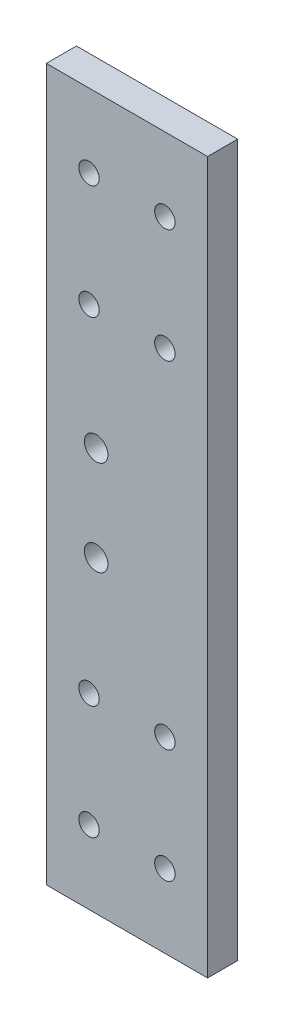
ISO-10303-21;
HEADER;
FILE_DESCRIPTION(('STEP AP214'),'2;1');
FILE_NAME('part.step','',(''),(''),'','','');
FILE_SCHEMA(('AUTOMOTIVE_DESIGN { 1 0 10303 214 1 1 1 1 }'));
ENDSEC;
DATA;
#1=APPLICATION_CONTEXT('core data for automotive mechanical design processes');
#2=APPLICATION_PROTOCOL_DEFINITION('international standard','automotive_design',2000,#1);
#3=PRODUCT_CONTEXT('',#1,'mechanical');
#4=PRODUCT('Part','Part','',(#3));
#5=PRODUCT_RELATED_PRODUCT_CATEGORY('part','',(#4));
#6=PRODUCT_DEFINITION_FORMATION('','',#4);
#7=PRODUCT_DEFINITION_CONTEXT('part definition',#1,'design');
#8=PRODUCT_DEFINITION('design','',#6,#7);
#9=PRODUCT_DEFINITION_SHAPE('','',#8);
#10=(LENGTH_UNIT() NAMED_UNIT(*) SI_UNIT(.MILLI.,.METRE.));
#11=(NAMED_UNIT(*) PLANE_ANGLE_UNIT() SI_UNIT($,.RADIAN.));
#12=(NAMED_UNIT(*) SI_UNIT($,.STERADIAN.) SOLID_ANGLE_UNIT());
#13=UNCERTAINTY_MEASURE_WITH_UNIT(LENGTH_MEASURE(1.E-05),#10,'distance_accuracy_value','');
#14=(GEOMETRIC_REPRESENTATION_CONTEXT(3) GLOBAL_UNCERTAINTY_ASSIGNED_CONTEXT((#13)) GLOBAL_UNIT_ASSIGNED_CONTEXT((#10,
#11,#12)) REPRESENTATION_CONTEXT('',''));
#15=CARTESIAN_POINT('',(0.,0.,0.));
#16=DIRECTION('',(0.,0.,1.));
#17=DIRECTION('',(1.,0.,0.));
#18=AXIS2_PLACEMENT_3D('',#15,#16,#17);
#19=CARTESIAN_POINT('',(-17.,-75.,6.35));
#20=DIRECTION('',(0.,1.,0.));
#21=DIRECTION('',(0.,0.,1.));
#22=AXIS2_PLACEMENT_3D('',#19,#20,#21);
#23=PLANE('',#22);
#24=DIRECTION('',(1.,0.,0.));
#25=VECTOR('',#24,1.);
#26=CARTESIAN_POINT('',(-17.,-75.,0.));
#27=LINE('',#26,#25);
#28=CARTESIAN_POINT('',(-17.,-75.,0.));
#29=VERTEX_POINT('',#28);
#30=CARTESIAN_POINT('',(17.,-75.,0.));
#31=VERTEX_POINT('',#30);
#32=EDGE_CURVE('E96',#29,#31,#27,.T.);
#33=ORIENTED_EDGE('',*,*,#32,.T.);
#34=DIRECTION('',(0.,0.,-1.));
#35=VECTOR('',#34,1.);
#36=CARTESIAN_POINT('',(17.,-75.,6.35));
#37=LINE('',#36,#35);
#38=CARTESIAN_POINT('',(17.,-75.,6.35));
#39=VERTEX_POINT('',#38);
#40=EDGE_CURVE('E11',#39,#31,#37,.T.);
#41=ORIENTED_EDGE('',*,*,#40,.F.);
#42=DIRECTION('',(1.,0.,0.));
#43=VECTOR('',#42,1.);
#44=CARTESIAN_POINT('',(-17.,-75.,6.35));
#45=LINE('',#44,#43);
#46=CARTESIAN_POINT('',(-17.,-75.,6.35));
#47=VERTEX_POINT('',#46);
#48=EDGE_CURVE('E84',#47,#39,#45,.T.);
#49=ORIENTED_EDGE('',*,*,#48,.F.);
#50=DIRECTION('',(0.,0.,-1.));
#51=VECTOR('',#50,1.);
#52=CARTESIAN_POINT('',(-17.,-75.,6.35));
#53=LINE('',#52,#51);
#54=EDGE_CURVE('E92',#47,#29,#53,.T.);
#55=ORIENTED_EDGE('',*,*,#54,.T.);
#56=EDGE_LOOP('',(#33,#41,#49,#55));
#57=FACE_BOUND('',#56,.T.);
#58=ADVANCED_FACE('F33',(#57),#23,.F.);
#59=CARTESIAN_POINT('',(17.,-75.,6.35));
#60=DIRECTION('',(-1.,0.,0.));
#61=DIRECTION('',(0.,0.,1.));
#62=AXIS2_PLACEMENT_3D('',#59,#60,#61);
#63=PLANE('',#62);
#64=DIRECTION('',(0.,1.,0.));
#65=VECTOR('',#64,1.);
#66=CARTESIAN_POINT('',(17.,-75.,0.));
#67=LINE('',#66,#65);
#68=CARTESIAN_POINT('',(17.,75.,0.));
#69=VERTEX_POINT('',#68);
#70=EDGE_CURVE('E88',#31,#69,#67,.T.);
#71=ORIENTED_EDGE('',*,*,#70,.T.);
#72=DIRECTION('',(0.,0.,-1.));
#73=VECTOR('',#72,1.);
#74=CARTESIAN_POINT('',(17.,75.,6.35));
#75=LINE('',#74,#73);
#76=CARTESIAN_POINT('',(17.,75.,6.35));
#77=VERTEX_POINT('',#76);
#78=EDGE_CURVE('E41',#77,#69,#75,.T.);
#79=ORIENTED_EDGE('',*,*,#78,.F.);
#80=DIRECTION('',(0.,1.,0.));
#81=VECTOR('',#80,1.);
#82=CARTESIAN_POINT('',(17.,-75.,6.35));
#83=LINE('',#82,#81);
#84=EDGE_CURVE('E79',#39,#77,#83,.T.);
#85=ORIENTED_EDGE('',*,*,#84,.F.);
#86=ORIENTED_EDGE('',*,*,#40,.T.);
#87=EDGE_LOOP('',(#71,#79,#85,#86));
#88=FACE_BOUND('',#87,.T.);
#89=ADVANCED_FACE('F87',(#88),#63,.F.);
#90=CARTESIAN_POINT('',(-17.,75.,6.35));
#91=DIRECTION('',(0.,-1.,0.));
#92=DIRECTION('',(0.,0.,-1.));
#93=AXIS2_PLACEMENT_3D('',#90,#91,#92);
#94=PLANE('',#93);
#95=DIRECTION('',(-1.,0.,0.));
#96=VECTOR('',#95,1.);
#97=CARTESIAN_POINT('',(-17.,75.,0.));
#98=LINE('',#97,#96);
#99=CARTESIAN_POINT('',(-17.,75.,0.));
#100=VERTEX_POINT('',#99);
#101=EDGE_CURVE('E66',#69,#100,#98,.T.);
#102=ORIENTED_EDGE('',*,*,#101,.T.);
#103=DIRECTION('',(0.,0.,-1.));
#104=VECTOR('',#103,1.);
#105=CARTESIAN_POINT('',(-17.,75.,6.35));
#106=LINE('',#105,#104);
#107=CARTESIAN_POINT('',(-17.,75.,6.35));
#108=VERTEX_POINT('',#107);
#109=EDGE_CURVE('E89',#108,#100,#106,.T.);
#110=ORIENTED_EDGE('',*,*,#109,.F.);
#111=DIRECTION('',(-1.,0.,0.));
#112=VECTOR('',#111,1.);
#113=CARTESIAN_POINT('',(-17.,75.,6.35));
#114=LINE('',#113,#112);
#115=EDGE_CURVE('E82',#77,#108,#114,.T.);
#116=ORIENTED_EDGE('',*,*,#115,.F.);
#117=ORIENTED_EDGE('',*,*,#78,.T.);
#118=EDGE_LOOP('',(#102,#110,#116,#117));
#119=FACE_BOUND('',#118,.T.);
#120=ADVANCED_FACE('F90',(#119),#94,.F.);
#121=CARTESIAN_POINT('',(-17.,-75.,6.35));
#122=DIRECTION('',(1.,0.,0.));
#123=DIRECTION('',(0.,0.,-1.));
#124=AXIS2_PLACEMENT_3D('',#121,#122,#123);
#125=PLANE('',#124);
#126=DIRECTION('',(0.,-1.,0.));
#127=VECTOR('',#126,1.);
#128=CARTESIAN_POINT('',(-17.,-75.,0.));
#129=LINE('',#128,#127);
#130=EDGE_CURVE('E72',#100,#29,#129,.T.);
#131=ORIENTED_EDGE('',*,*,#130,.T.);
#132=ORIENTED_EDGE('',*,*,#54,.F.);
#133=DIRECTION('',(0.,-1.,0.));
#134=VECTOR('',#133,1.);
#135=CARTESIAN_POINT('',(-17.,-75.,6.35));
#136=LINE('',#135,#134);
#137=EDGE_CURVE('E49',#108,#47,#136,.T.);
#138=ORIENTED_EDGE('',*,*,#137,.F.);
#139=ORIENTED_EDGE('',*,*,#109,.T.);
#140=EDGE_LOOP('',(#131,#132,#138,#139));
#141=FACE_BOUND('',#140,.T.);
#142=ADVANCED_FACE('F104',(#141),#125,.F.);
#143=CARTESIAN_POINT('',(0.,0.,6.35));
#144=DIRECTION('',(0.,0.,1.));
#145=DIRECTION('',(1.,0.,0.));
#146=AXIS2_PLACEMENT_3D('',#143,#144,#145);
#147=PLANE('',#146);
#148=CARTESIAN_POINT('',(-6.5,10.,6.35));
#149=DIRECTION('',(0.,0.,1.));
#150=DIRECTION('',(1.,0.,0.));
#151=AXIS2_PLACEMENT_3D('',#148,#149,#150);
#152=CIRCLE('',#151,2.48919999999999);
#153=CARTESIAN_POINT('',(-4.01080000000001,10.,6.35));
#154=VERTEX_POINT('',#153);
#155=EDGE_CURVE('E166',#154,#154,#152,.T.);
#156=ORIENTED_EDGE('',*,*,#155,.F.);
#157=EDGE_LOOP('',(#156));
#158=FACE_BOUND('',#157,.T.);
#159=CARTESIAN_POINT('',(-6.5,-10.,6.35));
#160=DIRECTION('',(0.,0.,1.));
#161=DIRECTION('',(1.,0.,0.));
#162=AXIS2_PLACEMENT_3D('',#159,#160,#161);
#163=CIRCLE('',#162,2.48919999999999);
#164=CARTESIAN_POINT('',(-4.01080000000001,-10.,6.35));
#165=VERTEX_POINT('',#164);
#166=EDGE_CURVE('E160',#165,#165,#163,.T.);
#167=ORIENTED_EDGE('',*,*,#166,.F.);
#168=EDGE_LOOP('',(#167));
#169=FACE_BOUND('',#168,.T.);
#170=CARTESIAN_POINT('',(-8.,59.5,6.35));
#171=DIRECTION('',(0.,0.,1.));
#172=DIRECTION('',(1.,0.,0.));
#173=AXIS2_PLACEMENT_3D('',#170,#171,#172);
#174=CIRCLE('',#173,2.15265);
#175=CARTESIAN_POINT('',(-5.84735,59.5,6.35));
#176=VERTEX_POINT('',#175);
#177=EDGE_CURVE('E154',#176,#176,#174,.T.);
#178=ORIENTED_EDGE('',*,*,#177,.F.);
#179=EDGE_LOOP('',(#178));
#180=FACE_BOUND('',#179,.T.);
#181=CARTESIAN_POINT('',(8.,59.5,6.35));
#182=DIRECTION('',(0.,0.,1.));
#183=DIRECTION('',(1.,0.,0.));
#184=AXIS2_PLACEMENT_3D('',#181,#182,#183);
#185=CIRCLE('',#184,2.15265);
#186=CARTESIAN_POINT('',(10.15265,59.5,6.35));
#187=VERTEX_POINT('',#186);
#188=EDGE_CURVE('E148',#187,#187,#185,.T.);
#189=ORIENTED_EDGE('',*,*,#188,.F.);
#190=EDGE_LOOP('',(#189));
#191=FACE_BOUND('',#190,.T.);
#192=CARTESIAN_POINT('',(8.,35.5,6.35));
#193=DIRECTION('',(0.,0.,1.));
#194=DIRECTION('',(1.,0.,0.));
#195=AXIS2_PLACEMENT_3D('',#192,#193,#194);
#196=CIRCLE('',#195,2.15265);
#197=CARTESIAN_POINT('',(10.15265,35.5,6.35));
#198=VERTEX_POINT('',#197);
#199=EDGE_CURVE('E142',#198,#198,#196,.T.);
#200=ORIENTED_EDGE('',*,*,#199,.F.);
#201=EDGE_LOOP('',(#200));
#202=FACE_BOUND('',#201,.T.);
#203=CARTESIAN_POINT('',(-8.,35.5,6.35));
#204=DIRECTION('',(0.,0.,1.));
#205=DIRECTION('',(1.,0.,0.));
#206=AXIS2_PLACEMENT_3D('',#203,#204,#205);
#207=CIRCLE('',#206,2.15265);
#208=CARTESIAN_POINT('',(-5.84735,35.5,6.35));
#209=VERTEX_POINT('',#208);
#210=EDGE_CURVE('E136',#209,#209,#207,.T.);
#211=ORIENTED_EDGE('',*,*,#210,.F.);
#212=EDGE_LOOP('',(#211));
#213=FACE_BOUND('',#212,.T.);
#214=CARTESIAN_POINT('',(-7.99999999999999,-35.5,6.35));
#215=DIRECTION('',(0.,0.,1.));
#216=DIRECTION('',(1.,0.,0.));
#217=AXIS2_PLACEMENT_3D('',#214,#215,#216);
#218=CIRCLE('',#217,2.15265);
#219=CARTESIAN_POINT('',(-5.84734999999999,-35.5,6.35));
#220=VERTEX_POINT('',#219);
#221=EDGE_CURVE('E130',#220,#220,#218,.T.);
#222=ORIENTED_EDGE('',*,*,#221,.F.);
#223=EDGE_LOOP('',(#222));
#224=FACE_BOUND('',#223,.T.);
#225=CARTESIAN_POINT('',(-8.,-59.5,6.35));
#226=DIRECTION('',(0.,0.,1.));
#227=DIRECTION('',(1.,0.,0.));
#228=AXIS2_PLACEMENT_3D('',#225,#226,#227);
#229=CIRCLE('',#228,2.15265);
#230=CARTESIAN_POINT('',(-5.84735,-59.5,6.35));
#231=VERTEX_POINT('',#230);
#232=EDGE_CURVE('E124',#231,#231,#229,.T.);
#233=ORIENTED_EDGE('',*,*,#232,.F.);
#234=EDGE_LOOP('',(#233));
#235=FACE_BOUND('',#234,.T.);
#236=CARTESIAN_POINT('',(8.,-59.5,6.35));
#237=DIRECTION('',(0.,0.,1.));
#238=DIRECTION('',(1.,0.,0.));
#239=AXIS2_PLACEMENT_3D('',#236,#237,#238);
#240=CIRCLE('',#239,2.15265);
#241=CARTESIAN_POINT('',(10.15265,-59.5,6.35));
#242=VERTEX_POINT('',#241);
#243=EDGE_CURVE('E118',#242,#242,#240,.T.);
#244=ORIENTED_EDGE('',*,*,#243,.F.);
#245=EDGE_LOOP('',(#244));
#246=FACE_BOUND('',#245,.T.);
#247=CARTESIAN_POINT('',(8.00000000000001,-35.5,6.35));
#248=DIRECTION('',(0.,0.,1.));
#249=DIRECTION('',(1.,0.,0.));
#250=AXIS2_PLACEMENT_3D('',#247,#248,#249);
#251=CIRCLE('',#250,2.15265);
#252=CARTESIAN_POINT('',(10.15265,-35.5,6.35));
#253=VERTEX_POINT('',#252);
#254=EDGE_CURVE('E112',#253,#253,#251,.T.);
#255=ORIENTED_EDGE('',*,*,#254,.F.);
#256=EDGE_LOOP('',(#255));
#257=FACE_BOUND('',#256,.T.);
#258=ORIENTED_EDGE('',*,*,#48,.T.);
#259=ORIENTED_EDGE('',*,*,#84,.T.);
#260=ORIENTED_EDGE('',*,*,#115,.T.);
#261=ORIENTED_EDGE('',*,*,#137,.T.);
#262=EDGE_LOOP('',(#258,#259,#260,#261));
#263=FACE_BOUND('',#262,.T.);
#264=ADVANCED_FACE('F80',(#158,#169,#180,#191,#202,#213,#224,#235,#246,#257,#263),#147,.T.);
#265=CARTESIAN_POINT('',(0.,0.,0.));
#266=DIRECTION('',(0.,0.,1.));
#267=DIRECTION('',(1.,0.,0.));
#268=AXIS2_PLACEMENT_3D('',#265,#266,#267);
#269=PLANE('',#268);
#270=CARTESIAN_POINT('',(-6.5,10.,0.));
#271=DIRECTION('',(0.,0.,1.));
#272=DIRECTION('',(1.,0.,0.));
#273=AXIS2_PLACEMENT_3D('',#270,#271,#272);
#274=CIRCLE('',#273,2.4892);
#275=CARTESIAN_POINT('',(-4.0108,10.,0.));
#276=VERTEX_POINT('',#275);
#277=EDGE_CURVE('E163',#276,#276,#274,.T.);
#278=ORIENTED_EDGE('',*,*,#277,.T.);
#279=EDGE_LOOP('',(#278));
#280=FACE_BOUND('',#279,.T.);
#281=CARTESIAN_POINT('',(-6.5,-10.,0.));
#282=DIRECTION('',(0.,0.,1.));
#283=DIRECTION('',(1.,0.,0.));
#284=AXIS2_PLACEMENT_3D('',#281,#282,#283);
#285=CIRCLE('',#284,2.4892);
#286=CARTESIAN_POINT('',(-4.0108,-10.,0.));
#287=VERTEX_POINT('',#286);
#288=EDGE_CURVE('E157',#287,#287,#285,.T.);
#289=ORIENTED_EDGE('',*,*,#288,.T.);
#290=EDGE_LOOP('',(#289));
#291=FACE_BOUND('',#290,.T.);
#292=CARTESIAN_POINT('',(-8.,59.5,0.));
#293=DIRECTION('',(0.,0.,1.));
#294=DIRECTION('',(1.,0.,0.));
#295=AXIS2_PLACEMENT_3D('',#292,#293,#294);
#296=CIRCLE('',#295,2.15265);
#297=CARTESIAN_POINT('',(-5.84735,59.5,0.));
#298=VERTEX_POINT('',#297);
#299=EDGE_CURVE('E151',#298,#298,#296,.T.);
#300=ORIENTED_EDGE('',*,*,#299,.T.);
#301=EDGE_LOOP('',(#300));
#302=FACE_BOUND('',#301,.T.);
#303=CARTESIAN_POINT('',(8.,59.5,0.));
#304=DIRECTION('',(0.,0.,1.));
#305=DIRECTION('',(1.,0.,0.));
#306=AXIS2_PLACEMENT_3D('',#303,#304,#305);
#307=CIRCLE('',#306,2.15265);
#308=CARTESIAN_POINT('',(10.15265,59.5,0.));
#309=VERTEX_POINT('',#308);
#310=EDGE_CURVE('E145',#309,#309,#307,.T.);
#311=ORIENTED_EDGE('',*,*,#310,.T.);
#312=EDGE_LOOP('',(#311));
#313=FACE_BOUND('',#312,.T.);
#314=CARTESIAN_POINT('',(8.,35.5,0.));
#315=DIRECTION('',(0.,0.,1.));
#316=DIRECTION('',(1.,0.,0.));
#317=AXIS2_PLACEMENT_3D('',#314,#315,#316);
#318=CIRCLE('',#317,2.15265);
#319=CARTESIAN_POINT('',(10.15265,35.5,0.));
#320=VERTEX_POINT('',#319);
#321=EDGE_CURVE('E139',#320,#320,#318,.T.);
#322=ORIENTED_EDGE('',*,*,#321,.T.);
#323=EDGE_LOOP('',(#322));
#324=FACE_BOUND('',#323,.T.);
#325=CARTESIAN_POINT('',(-8.,35.5,0.));
#326=DIRECTION('',(0.,0.,1.));
#327=DIRECTION('',(1.,0.,0.));
#328=AXIS2_PLACEMENT_3D('',#325,#326,#327);
#329=CIRCLE('',#328,2.15265);
#330=CARTESIAN_POINT('',(-5.84735,35.5,0.));
#331=VERTEX_POINT('',#330);
#332=EDGE_CURVE('E133',#331,#331,#329,.T.);
#333=ORIENTED_EDGE('',*,*,#332,.T.);
#334=EDGE_LOOP('',(#333));
#335=FACE_BOUND('',#334,.T.);
#336=CARTESIAN_POINT('',(-7.99999999999999,-35.5,0.));
#337=DIRECTION('',(0.,0.,1.));
#338=DIRECTION('',(1.,0.,0.));
#339=AXIS2_PLACEMENT_3D('',#336,#337,#338);
#340=CIRCLE('',#339,2.15265);
#341=CARTESIAN_POINT('',(-5.84734999999999,-35.5,0.));
#342=VERTEX_POINT('',#341);
#343=EDGE_CURVE('E127',#342,#342,#340,.T.);
#344=ORIENTED_EDGE('',*,*,#343,.T.);
#345=EDGE_LOOP('',(#344));
#346=FACE_BOUND('',#345,.T.);
#347=CARTESIAN_POINT('',(-8.,-59.5,0.));
#348=DIRECTION('',(0.,0.,1.));
#349=DIRECTION('',(1.,0.,0.));
#350=AXIS2_PLACEMENT_3D('',#347,#348,#349);
#351=CIRCLE('',#350,2.15265);
#352=CARTESIAN_POINT('',(-5.84735,-59.5,0.));
#353=VERTEX_POINT('',#352);
#354=EDGE_CURVE('E121',#353,#353,#351,.T.);
#355=ORIENTED_EDGE('',*,*,#354,.T.);
#356=EDGE_LOOP('',(#355));
#357=FACE_BOUND('',#356,.T.);
#358=CARTESIAN_POINT('',(8.,-59.5,0.));
#359=DIRECTION('',(0.,0.,1.));
#360=DIRECTION('',(1.,0.,0.));
#361=AXIS2_PLACEMENT_3D('',#358,#359,#360);
#362=CIRCLE('',#361,2.15265);
#363=CARTESIAN_POINT('',(10.15265,-59.5,0.));
#364=VERTEX_POINT('',#363);
#365=EDGE_CURVE('E115',#364,#364,#362,.T.);
#366=ORIENTED_EDGE('',*,*,#365,.T.);
#367=EDGE_LOOP('',(#366));
#368=FACE_BOUND('',#367,.T.);
#369=CARTESIAN_POINT('',(8.00000000000001,-35.5,0.));
#370=DIRECTION('',(0.,0.,1.));
#371=DIRECTION('',(1.,0.,0.));
#372=AXIS2_PLACEMENT_3D('',#369,#370,#371);
#373=CIRCLE('',#372,2.15265);
#374=CARTESIAN_POINT('',(10.15265,-35.5,0.));
#375=VERTEX_POINT('',#374);
#376=EDGE_CURVE('E99',#375,#375,#373,.T.);
#377=ORIENTED_EDGE('',*,*,#376,.T.);
#378=EDGE_LOOP('',(#377));
#379=FACE_BOUND('',#378,.T.);
#380=ORIENTED_EDGE('',*,*,#32,.F.);
#381=ORIENTED_EDGE('',*,*,#130,.F.);
#382=ORIENTED_EDGE('',*,*,#101,.F.);
#383=ORIENTED_EDGE('',*,*,#70,.F.);
#384=EDGE_LOOP('',(#380,#381,#382,#383));
#385=FACE_BOUND('',#384,.T.);
#386=ADVANCED_FACE('F107',(#280,#291,#302,#313,#324,#335,#346,#357,#368,#379,#385),#269,.F.);
#387=CARTESIAN_POINT('',(8.00000000000001,-35.5,6.35));
#388=DIRECTION('',(0.,0.,1.));
#389=DIRECTION('',(1.,0.,0.));
#390=AXIS2_PLACEMENT_3D('',#387,#388,#389);
#391=CYLINDRICAL_SURFACE('',#390,2.15265);
#392=ORIENTED_EDGE('',*,*,#376,.F.);
#393=EDGE_LOOP('',(#392));
#394=FACE_BOUND('',#393,.T.);
#395=ORIENTED_EDGE('',*,*,#254,.T.);
#396=EDGE_LOOP('',(#395));
#397=FACE_BOUND('',#396,.T.);
#398=ADVANCED_FACE('F193',(#394,#397),#391,.F.);
#399=CARTESIAN_POINT('',(8.,-59.5,6.35));
#400=DIRECTION('',(0.,0.,1.));
#401=DIRECTION('',(1.,0.,0.));
#402=AXIS2_PLACEMENT_3D('',#399,#400,#401);
#403=CYLINDRICAL_SURFACE('',#402,2.15265);
#404=ORIENTED_EDGE('',*,*,#365,.F.);
#405=EDGE_LOOP('',(#404));
#406=FACE_BOUND('',#405,.T.);
#407=ORIENTED_EDGE('',*,*,#243,.T.);
#408=EDGE_LOOP('',(#407));
#409=FACE_BOUND('',#408,.T.);
#410=ADVANCED_FACE('F195',(#406,#409),#403,.F.);
#411=CARTESIAN_POINT('',(-8.,-59.5,6.35));
#412=DIRECTION('',(0.,0.,1.));
#413=DIRECTION('',(1.,0.,0.));
#414=AXIS2_PLACEMENT_3D('',#411,#412,#413);
#415=CYLINDRICAL_SURFACE('',#414,2.15265);
#416=ORIENTED_EDGE('',*,*,#354,.F.);
#417=EDGE_LOOP('',(#416));
#418=FACE_BOUND('',#417,.T.);
#419=ORIENTED_EDGE('',*,*,#232,.T.);
#420=EDGE_LOOP('',(#419));
#421=FACE_BOUND('',#420,.T.);
#422=ADVANCED_FACE('F202',(#418,#421),#415,.F.);
#423=CARTESIAN_POINT('',(-7.99999999999999,-35.5,6.35));
#424=DIRECTION('',(0.,0.,1.));
#425=DIRECTION('',(1.,0.,0.));
#426=AXIS2_PLACEMENT_3D('',#423,#424,#425);
#427=CYLINDRICAL_SURFACE('',#426,2.15265);
#428=ORIENTED_EDGE('',*,*,#343,.F.);
#429=EDGE_LOOP('',(#428));
#430=FACE_BOUND('',#429,.T.);
#431=ORIENTED_EDGE('',*,*,#221,.T.);
#432=EDGE_LOOP('',(#431));
#433=FACE_BOUND('',#432,.T.);
#434=ADVANCED_FACE('F273',(#430,#433),#427,.F.);
#435=CARTESIAN_POINT('',(-8.,35.5,6.35));
#436=DIRECTION('',(0.,0.,1.));
#437=DIRECTION('',(1.,0.,0.));
#438=AXIS2_PLACEMENT_3D('',#435,#436,#437);
#439=CYLINDRICAL_SURFACE('',#438,2.15265);
#440=ORIENTED_EDGE('',*,*,#332,.F.);
#441=EDGE_LOOP('',(#440));
#442=FACE_BOUND('',#441,.T.);
#443=ORIENTED_EDGE('',*,*,#210,.T.);
#444=EDGE_LOOP('',(#443));
#445=FACE_BOUND('',#444,.T.);
#446=ADVANCED_FACE('F269',(#442,#445),#439,.F.);
#447=CARTESIAN_POINT('',(8.,35.5,6.35));
#448=DIRECTION('',(0.,0.,1.));
#449=DIRECTION('',(1.,0.,0.));
#450=AXIS2_PLACEMENT_3D('',#447,#448,#449);
#451=CYLINDRICAL_SURFACE('',#450,2.15265);
#452=ORIENTED_EDGE('',*,*,#321,.F.);
#453=EDGE_LOOP('',(#452));
#454=FACE_BOUND('',#453,.T.);
#455=ORIENTED_EDGE('',*,*,#199,.T.);
#456=EDGE_LOOP('',(#455));
#457=FACE_BOUND('',#456,.T.);
#458=ADVANCED_FACE('F265',(#454,#457),#451,.F.);
#459=CARTESIAN_POINT('',(8.,59.5,6.35));
#460=DIRECTION('',(0.,0.,1.));
#461=DIRECTION('',(1.,0.,0.));
#462=AXIS2_PLACEMENT_3D('',#459,#460,#461);
#463=CYLINDRICAL_SURFACE('',#462,2.15265);
#464=ORIENTED_EDGE('',*,*,#310,.F.);
#465=EDGE_LOOP('',(#464));
#466=FACE_BOUND('',#465,.T.);
#467=ORIENTED_EDGE('',*,*,#188,.T.);
#468=EDGE_LOOP('',(#467));
#469=FACE_BOUND('',#468,.T.);
#470=ADVANCED_FACE('F261',(#466,#469),#463,.F.);
#471=CARTESIAN_POINT('',(-8.,59.5,6.35));
#472=DIRECTION('',(0.,0.,1.));
#473=DIRECTION('',(1.,0.,0.));
#474=AXIS2_PLACEMENT_3D('',#471,#472,#473);
#475=CYLINDRICAL_SURFACE('',#474,2.15265);
#476=ORIENTED_EDGE('',*,*,#299,.F.);
#477=EDGE_LOOP('',(#476));
#478=FACE_BOUND('',#477,.T.);
#479=ORIENTED_EDGE('',*,*,#177,.T.);
#480=EDGE_LOOP('',(#479));
#481=FACE_BOUND('',#480,.T.);
#482=ADVANCED_FACE('F242',(#478,#481),#475,.F.);
#483=CARTESIAN_POINT('',(-6.5,-10.,6.35));
#484=DIRECTION('',(0.,0.,1.));
#485=DIRECTION('',(1.,0.,0.));
#486=AXIS2_PLACEMENT_3D('',#483,#484,#485);
#487=CYLINDRICAL_SURFACE('',#486,2.48919999999999);
#488=ORIENTED_EDGE('',*,*,#288,.F.);
#489=EDGE_LOOP('',(#488));
#490=FACE_BOUND('',#489,.T.);
#491=ORIENTED_EDGE('',*,*,#166,.T.);
#492=EDGE_LOOP('',(#491));
#493=FACE_BOUND('',#492,.T.);
#494=ADVANCED_FACE('F237',(#490,#493),#487,.F.);
#495=CARTESIAN_POINT('',(-6.5,10.,6.35));
#496=DIRECTION('',(0.,0.,1.));
#497=DIRECTION('',(1.,0.,0.));
#498=AXIS2_PLACEMENT_3D('',#495,#496,#497);
#499=CYLINDRICAL_SURFACE('',#498,2.48919999999999);
#500=ORIENTED_EDGE('',*,*,#277,.F.);
#501=EDGE_LOOP('',(#500));
#502=FACE_BOUND('',#501,.T.);
#503=ORIENTED_EDGE('',*,*,#155,.T.);
#504=EDGE_LOOP('',(#503));
#505=FACE_BOUND('',#504,.T.);
#506=ADVANCED_FACE('F170',(#502,#505),#499,.F.);
#507=CLOSED_SHELL('',(#58,#89,#120,#142,#264,#386,#398,#410,#422,#434,#446,#458,#470,#482,#494,#506));
#508=MANIFOLD_SOLID_BREP('B2',#507);
#509=ADVANCED_BREP_SHAPE_REPRESENTATION('',(#18,#508),#14);
#510=SHAPE_DEFINITION_REPRESENTATION(#9,#509);
ENDSEC;
END-ISO-10303-21;
